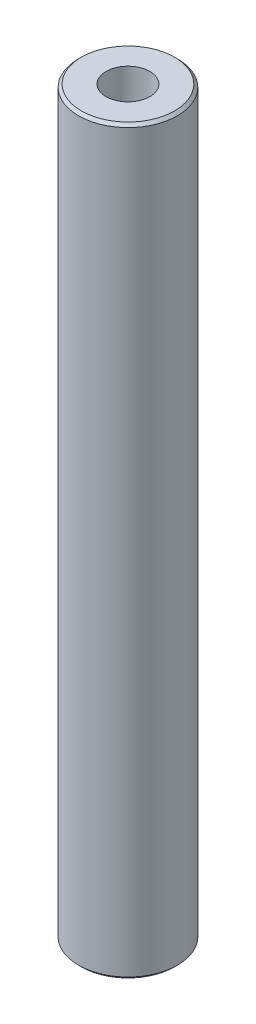
ISO-10303-21;
HEADER;
FILE_DESCRIPTION(('STEP AP214'),'2;1');
FILE_NAME('part.step','',(''),(''),'','','');
FILE_SCHEMA(('AUTOMOTIVE_DESIGN { 1 0 10303 214 1 1 1 1 }'));
ENDSEC;
DATA;
#1=APPLICATION_CONTEXT('core data for automotive mechanical design processes');
#2=APPLICATION_PROTOCOL_DEFINITION('international standard','automotive_design',2000,#1);
#3=PRODUCT_CONTEXT('',#1,'mechanical');
#4=PRODUCT('Part','Part','',(#3));
#5=PRODUCT_RELATED_PRODUCT_CATEGORY('part','',(#4));
#6=PRODUCT_DEFINITION_FORMATION('','',#4);
#7=PRODUCT_DEFINITION_CONTEXT('part definition',#1,'design');
#8=PRODUCT_DEFINITION('design','',#6,#7);
#9=PRODUCT_DEFINITION_SHAPE('','',#8);
#10=(LENGTH_UNIT() NAMED_UNIT(*) SI_UNIT(.MILLI.,.METRE.));
#11=(NAMED_UNIT(*) PLANE_ANGLE_UNIT() SI_UNIT($,.RADIAN.));
#12=(NAMED_UNIT(*) SI_UNIT($,.STERADIAN.) SOLID_ANGLE_UNIT());
#13=UNCERTAINTY_MEASURE_WITH_UNIT(LENGTH_MEASURE(1.E-05),#10,'distance_accuracy_value','');
#14=(GEOMETRIC_REPRESENTATION_CONTEXT(3) GLOBAL_UNCERTAINTY_ASSIGNED_CONTEXT((#13)) GLOBAL_UNIT_ASSIGNED_CONTEXT((#10,
#11,#12)) REPRESENTATION_CONTEXT('',''));
#15=CARTESIAN_POINT('',(0.,0.,0.));
#16=DIRECTION('',(0.,0.,1.));
#17=DIRECTION('',(1.,0.,0.));
#18=AXIS2_PLACEMENT_3D('',#15,#16,#17);
#19=CARTESIAN_POINT('',(0.,600.,0.));
#20=DIRECTION('',(0.,-1.,0.));
#21=DIRECTION('',(0.,0.,-1.));
#22=AXIS2_PLACEMENT_3D('',#19,#20,#21);
#23=CYLINDRICAL_SURFACE('',#22,40.);
#24=CARTESIAN_POINT('',(0.,597.72506355566,0.));
#25=DIRECTION('',(0.,1.,0.));
#26=DIRECTION('',(0.,0.,1.));
#27=AXIS2_PLACEMENT_3D('',#24,#25,#26);
#28=CIRCLE('',#27,40.);
#29=CARTESIAN_POINT('',(0.,597.72506355566,40.));
#30=VERTEX_POINT('',#29);
#31=EDGE_CURVE('E50',#30,#30,#28,.F.);
#32=ORIENTED_EDGE('',*,*,#31,.T.);
#33=EDGE_LOOP('',(#32));
#34=FACE_BOUND('',#33,.T.);
#35=CARTESIAN_POINT('',(0.,2.28770014475166,0.));
#36=DIRECTION('',(0.,1.,0.));
#37=DIRECTION('',(0.,0.,1.));
#38=AXIS2_PLACEMENT_3D('',#35,#36,#37);
#39=CIRCLE('',#38,40.);
#40=CARTESIAN_POINT('',(0.,2.28770014475166,40.));
#41=VERTEX_POINT('',#40);
#42=EDGE_CURVE('E51',#41,#41,#39,.T.);
#43=ORIENTED_EDGE('',*,*,#42,.T.);
#44=EDGE_LOOP('',(#43));
#45=FACE_BOUND('',#44,.T.);
#46=ADVANCED_FACE('F39',(#34,#45),#23,.T.);
#47=CARTESIAN_POINT('',(0.,600.,0.));
#48=DIRECTION('',(0.,1.,0.));
#49=DIRECTION('',(0.,0.,1.));
#50=AXIS2_PLACEMENT_3D('',#47,#48,#49);
#51=PLANE('',#50);
#52=CARTESIAN_POINT('',(0.,600.,0.));
#53=DIRECTION('',(0.,1.,0.));
#54=DIRECTION('',(0.,0.,1.));
#55=AXIS2_PLACEMENT_3D('',#52,#53,#54);
#56=CIRCLE('',#55,37.7122998552483);
#57=CARTESIAN_POINT('',(0.,600.,37.7122998552483));
#58=VERTEX_POINT('',#57);
#59=EDGE_CURVE('E54',#58,#58,#56,.T.);
#60=ORIENTED_EDGE('',*,*,#59,.T.);
#61=EDGE_LOOP('',(#60));
#62=FACE_BOUND('',#61,.T.);
#63=CARTESIAN_POINT('',(0.,600.,0.));
#64=DIRECTION('',(0.,1.,0.));
#65=DIRECTION('',(0.,0.,1.));
#66=AXIS2_PLACEMENT_3D('',#63,#64,#65);
#67=CIRCLE('',#66,17.7134120926852);
#68=CARTESIAN_POINT('',(0.,600.,17.7134120926852));
#69=VERTEX_POINT('',#68);
#70=EDGE_CURVE('E58',#69,#69,#67,.T.);
#71=ORIENTED_EDGE('',*,*,#70,.F.);
#72=EDGE_LOOP('',(#71));
#73=FACE_BOUND('',#72,.T.);
#74=ADVANCED_FACE('F69',(#62,#73),#51,.T.);
#75=CARTESIAN_POINT('',(0.,0.,0.));
#76=DIRECTION('',(0.,1.,0.));
#77=DIRECTION('',(0.,0.,1.));
#78=AXIS2_PLACEMENT_3D('',#75,#76,#77);
#79=PLANE('',#78);
#80=CARTESIAN_POINT('',(0.,0.,0.));
#81=DIRECTION('',(0.,1.,0.));
#82=DIRECTION('',(0.,0.,1.));
#83=AXIS2_PLACEMENT_3D('',#80,#81,#82);
#84=CIRCLE('',#83,37.72506355566);
#85=CARTESIAN_POINT('',(0.,0.,37.72506355566));
#86=VERTEX_POINT('',#85);
#87=EDGE_CURVE('E10',#86,#86,#84,.F.);
#88=ORIENTED_EDGE('',*,*,#87,.T.);
#89=EDGE_LOOP('',(#88));
#90=FACE_BOUND('',#89,.T.);
#91=CARTESIAN_POINT('',(0.,0.,0.));
#92=DIRECTION('',(0.,1.,0.));
#93=DIRECTION('',(0.,0.,1.));
#94=AXIS2_PLACEMENT_3D('',#91,#92,#93);
#95=CIRCLE('',#94,17.7134120926852);
#96=CARTESIAN_POINT('',(0.,0.,17.7134120926852));
#97=VERTEX_POINT('',#96);
#98=EDGE_CURVE('E63',#97,#97,#95,.T.);
#99=ORIENTED_EDGE('',*,*,#98,.T.);
#100=EDGE_LOOP('',(#99));
#101=FACE_BOUND('',#100,.T.);
#102=ADVANCED_FACE('F75',(#90,#101),#79,.F.);
#103=CARTESIAN_POINT('',(0.,600.,0.));
#104=DIRECTION('',(0.,-1.,0.));
#105=DIRECTION('',(0.,0.,-1.));
#106=AXIS2_PLACEMENT_3D('',#103,#104,#105);
#107=CYLINDRICAL_SURFACE('',#106,17.7134120926852);
#108=ORIENTED_EDGE('',*,*,#70,.T.);
#109=EDGE_LOOP('',(#108));
#110=FACE_BOUND('',#109,.T.);
#111=ORIENTED_EDGE('',*,*,#98,.F.);
#112=EDGE_LOOP('',(#111));
#113=FACE_BOUND('',#112,.T.);
#114=ADVANCED_FACE('F70',(#110,#113),#107,.F.);
#115=CARTESIAN_POINT('',(0.,600.,0.));
#116=DIRECTION('',(0.,-1.,0.));
#117=DIRECTION('',(0.,0.,-1.));
#118=AXIS2_PLACEMENT_3D('',#115,#116,#117);
#119=CONICAL_SURFACE('',#118,37.7122998552483,0.788195595730215);
#120=ORIENTED_EDGE('',*,*,#31,.F.);
#121=EDGE_LOOP('',(#120));
#122=FACE_BOUND('',#121,.T.);
#123=ORIENTED_EDGE('',*,*,#59,.F.);
#124=EDGE_LOOP('',(#123));
#125=FACE_BOUND('',#124,.T.);
#126=ADVANCED_FACE('F81',(#122,#125),#119,.T.);
#127=CARTESIAN_POINT('',(0.,2.28770014475166,0.));
#128=DIRECTION('',(0.,1.,0.));
#129=DIRECTION('',(0.,0.,1.));
#130=AXIS2_PLACEMENT_3D('',#127,#128,#129);
#131=CONICAL_SURFACE('',#130,40.,0.782600731064678);
#132=ORIENTED_EDGE('',*,*,#87,.F.);
#133=EDGE_LOOP('',(#132));
#134=FACE_BOUND('',#133,.T.);
#135=ORIENTED_EDGE('',*,*,#42,.F.);
#136=EDGE_LOOP('',(#135));
#137=FACE_BOUND('',#136,.T.);
#138=ADVANCED_FACE('F45',(#134,#137),#131,.T.);
#139=CLOSED_SHELL('',(#46,#74,#102,#114,#126,#138));
#140=MANIFOLD_SOLID_BREP('B2',#139);
#141=ADVANCED_BREP_SHAPE_REPRESENTATION('',(#18,#140),#14);
#142=SHAPE_DEFINITION_REPRESENTATION(#9,#141);
ENDSEC;
END-ISO-10303-21;
